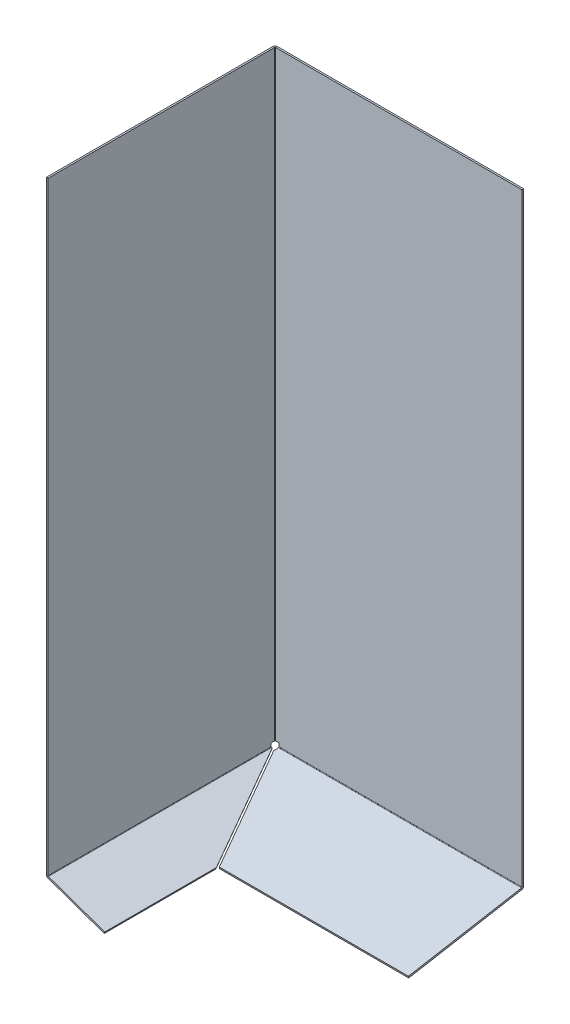
ISO-10303-21;
HEADER;
FILE_DESCRIPTION(('STEP AP214'),'2;1');
FILE_NAME('part.step','',(''),(''),'','','');
FILE_SCHEMA(('AUTOMOTIVE_DESIGN { 1 0 10303 214 1 1 1 1 }'));
ENDSEC;
DATA;
#1=APPLICATION_CONTEXT('core data for automotive mechanical design processes');
#2=APPLICATION_PROTOCOL_DEFINITION('international standard','automotive_design',2000,#1);
#3=PRODUCT_CONTEXT('',#1,'mechanical');
#4=PRODUCT('Part','Part','',(#3));
#5=PRODUCT_RELATED_PRODUCT_CATEGORY('part','',(#4));
#6=PRODUCT_DEFINITION_FORMATION('','',#4);
#7=PRODUCT_DEFINITION_CONTEXT('part definition',#1,'design');
#8=PRODUCT_DEFINITION('design','',#6,#7);
#9=PRODUCT_DEFINITION_SHAPE('','',#8);
#10=(LENGTH_UNIT() NAMED_UNIT(*) SI_UNIT(.MILLI.,.METRE.));
#11=(NAMED_UNIT(*) PLANE_ANGLE_UNIT() SI_UNIT($,.RADIAN.));
#12=(NAMED_UNIT(*) SI_UNIT($,.STERADIAN.) SOLID_ANGLE_UNIT());
#13=UNCERTAINTY_MEASURE_WITH_UNIT(LENGTH_MEASURE(1.E-05),#10,'distance_accuracy_value','');
#14=(GEOMETRIC_REPRESENTATION_CONTEXT(3) GLOBAL_UNCERTAINTY_ASSIGNED_CONTEXT((#13)) GLOBAL_UNIT_ASSIGNED_CONTEXT((#10,
#11,#12)) REPRESENTATION_CONTEXT('',''));
#15=CARTESIAN_POINT('',(0.,0.,0.));
#16=DIRECTION('',(0.,0.,1.));
#17=DIRECTION('',(1.,0.,0.));
#18=AXIS2_PLACEMENT_3D('',#15,#16,#17);
#19=CARTESIAN_POINT('',(0.,1100.,6.74999999999996));
#20=DIRECTION('',(0.,0.,1.));
#21=DIRECTION('',(0.,-1.,0.));
#22=AXIS2_PLACEMENT_3D('',#19,#20,#21);
#23=PLANE('',#22);
#24=DIRECTION('',(1.,0.,0.));
#25=VECTOR('',#24,1.);
#26=CARTESIAN_POINT('',(0.,35.9731028814059,6.74999999999996));
#27=LINE('',#26,#25);
#28=CARTESIAN_POINT('',(-3.,35.9731028814059,6.74999999999996));
#29=VERTEX_POINT('',#28);
#30=CARTESIAN_POINT('',(0.,35.9731028814059,6.74999999999996));
#31=VERTEX_POINT('',#30);
#32=EDGE_CURVE('E11',#29,#31,#27,.T.);
#33=ORIENTED_EDGE('',*,*,#32,.F.);
#34=DIRECTION('',(0.,1.,0.));
#35=VECTOR('',#34,1.);
#36=CARTESIAN_POINT('',(-3.,1100.,6.74999999999996));
#37=LINE('',#36,#35);
#38=CARTESIAN_POINT('',(-3.,42.0153961416918,6.74999999999996));
#39=VERTEX_POINT('',#38);
#40=EDGE_CURVE('E228',#39,#29,#37,.F.);
#41=ORIENTED_EDGE('',*,*,#40,.F.);
#42=DIRECTION('',(1.,0.,0.));
#43=VECTOR('',#42,1.);
#44=CARTESIAN_POINT('',(0.,42.0153961416918,6.74999999999996));
#45=LINE('',#44,#43);
#46=CARTESIAN_POINT('',(0.,42.0153961416918,6.74999999999996));
#47=VERTEX_POINT('',#46);
#48=EDGE_CURVE('E47',#39,#47,#45,.T.);
#49=ORIENTED_EDGE('',*,*,#48,.T.);
#50=DIRECTION('',(0.,-1.,0.));
#51=VECTOR('',#50,1.);
#52=CARTESIAN_POINT('',(0.,1100.,6.74999999999996));
#53=LINE('',#52,#51);
#54=EDGE_CURVE('E293',#47,#31,#53,.T.);
#55=ORIENTED_EDGE('',*,*,#54,.T.);
#56=EDGE_LOOP('',(#33,#41,#49,#55));
#57=FACE_BOUND('',#56,.T.);
#58=ADVANCED_FACE('F37',(#57),#23,.F.);
#59=CARTESIAN_POINT('',(0.,42.0153961416918,0.));
#60=DIRECTION('',(0.,1.,0.));
#61=DIRECTION('',(0.,0.,1.));
#62=AXIS2_PLACEMENT_3D('',#59,#60,#61);
#63=PLANE('',#62);
#64=ORIENTED_EDGE('',*,*,#48,.F.);
#65=DIRECTION('',(0.,0.,-1.));
#66=VECTOR('',#65,1.);
#67=CARTESIAN_POINT('',(-3.,42.0153961416918,0.));
#68=LINE('',#67,#66);
#69=CARTESIAN_POINT('',(-3.,42.0153961416918,1.));
#70=VERTEX_POINT('',#69);
#71=EDGE_CURVE('E220',#70,#39,#68,.F.);
#72=ORIENTED_EDGE('',*,*,#71,.F.);
#73=DIRECTION('',(1.,0.,0.));
#74=VECTOR('',#73,1.);
#75=CARTESIAN_POINT('',(0.,42.0153961416918,1.));
#76=LINE('',#75,#74);
#77=CARTESIAN_POINT('',(0.,42.0153961416918,1.));
#78=VERTEX_POINT('',#77);
#79=EDGE_CURVE('E287',#70,#78,#76,.T.);
#80=ORIENTED_EDGE('',*,*,#79,.T.);
#81=DIRECTION('',(0.,0.,1.));
#82=VECTOR('',#81,1.);
#83=CARTESIAN_POINT('',(0.,42.0153961416918,0.));
#84=LINE('',#83,#82);
#85=EDGE_CURVE('E305',#78,#47,#84,.T.);
#86=ORIENTED_EDGE('',*,*,#85,.T.);
#87=EDGE_LOOP('',(#64,#72,#80,#86));
#88=FACE_BOUND('',#87,.T.);
#89=ADVANCED_FACE('F312',(#88),#63,.F.);
#90=CARTESIAN_POINT('',(1.,42.0153961416918,1.));
#91=DIRECTION('',(0.,-1.,0.));
#92=DIRECTION('',(0.,0.,-1.));
#93=AXIS2_PLACEMENT_3D('',#90,#91,#92);
#94=PLANE('',#93);
#95=ORIENTED_EDGE('',*,*,#79,.F.);
#96=CARTESIAN_POINT('',(1.,42.0153961416918,1.));
#97=DIRECTION('',(0.,1.,0.));
#98=DIRECTION('',(0.,0.,1.));
#99=AXIS2_PLACEMENT_3D('',#96,#97,#98);
#100=CIRCLE('',#99,4.);
#101=CARTESIAN_POINT('',(1.,42.0153961416918,-3.));
#102=VERTEX_POINT('',#101);
#103=EDGE_CURVE('E205',#70,#102,#100,.F.);
#104=ORIENTED_EDGE('',*,*,#103,.T.);
#105=DIRECTION('',(0.,0.,1.));
#106=VECTOR('',#105,1.);
#107=CARTESIAN_POINT('',(1.,42.0153961416918,0.));
#108=LINE('',#107,#106);
#109=CARTESIAN_POINT('',(1.,42.0153961416918,0.));
#110=VERTEX_POINT('',#109);
#111=EDGE_CURVE('E284',#102,#110,#108,.T.);
#112=ORIENTED_EDGE('',*,*,#111,.T.);
#113=CARTESIAN_POINT('',(1.,42.0153961416918,1.));
#114=DIRECTION('',(0.,1.,0.));
#115=DIRECTION('',(0.,0.,1.));
#116=AXIS2_PLACEMENT_3D('',#113,#114,#115);
#117=CIRCLE('',#116,1.);
#118=EDGE_CURVE('E349',#78,#110,#117,.F.);
#119=ORIENTED_EDGE('',*,*,#118,.F.);
#120=EDGE_LOOP('',(#95,#104,#112,#119));
#121=FACE_BOUND('',#120,.T.);
#122=ADVANCED_FACE('F511',(#121),#94,.T.);
#123=CARTESIAN_POINT('',(0.,42.0153961416918,0.));
#124=DIRECTION('',(0.,1.,0.));
#125=DIRECTION('',(-1.,0.,0.));
#126=AXIS2_PLACEMENT_3D('',#123,#124,#125);
#127=PLANE('',#126);
#128=ORIENTED_EDGE('',*,*,#111,.F.);
#129=DIRECTION('',(1.,0.,0.));
#130=VECTOR('',#129,1.);
#131=CARTESIAN_POINT('',(0.,42.0153961416918,-3.));
#132=LINE('',#131,#130);
#133=CARTESIAN_POINT('',(6.74999999999996,42.0153961416918,-3.));
#134=VERTEX_POINT('',#133);
#135=EDGE_CURVE('E225',#134,#102,#132,.F.);
#136=ORIENTED_EDGE('',*,*,#135,.F.);
#137=DIRECTION('',(0.,0.,1.));
#138=VECTOR('',#137,1.);
#139=CARTESIAN_POINT('',(6.74999999999996,42.0153961416918,0.));
#140=LINE('',#139,#138);
#141=CARTESIAN_POINT('',(6.74999999999996,42.0153961416918,0.));
#142=VERTEX_POINT('',#141);
#143=EDGE_CURVE('E281',#134,#142,#140,.T.);
#144=ORIENTED_EDGE('',*,*,#143,.T.);
#145=DIRECTION('',(-1.,0.,0.));
#146=VECTOR('',#145,1.);
#147=CARTESIAN_POINT('',(0.,42.0153961416918,0.));
#148=LINE('',#147,#146);
#149=EDGE_CURVE('E310',#142,#110,#148,.T.);
#150=ORIENTED_EDGE('',*,*,#149,.T.);
#151=EDGE_LOOP('',(#128,#136,#144,#150));
#152=FACE_BOUND('',#151,.T.);
#153=ADVANCED_FACE('F431',(#152),#127,.F.);
#154=CARTESIAN_POINT('',(6.74999999999996,1100.,0.));
#155=DIRECTION('',(1.,0.,0.));
#156=DIRECTION('',(0.,1.,0.));
#157=AXIS2_PLACEMENT_3D('',#154,#155,#156);
#158=PLANE('',#157);
#159=ORIENTED_EDGE('',*,*,#143,.F.);
#160=DIRECTION('',(0.,1.,0.));
#161=VECTOR('',#160,1.);
#162=CARTESIAN_POINT('',(6.74999999999996,1100.,-3.));
#163=LINE('',#162,#161);
#164=CARTESIAN_POINT('',(6.74999999999996,36.1044957728691,-3.));
#165=VERTEX_POINT('',#164);
#166=EDGE_CURVE('E185',#165,#134,#163,.T.);
#167=ORIENTED_EDGE('',*,*,#166,.F.);
#168=DIRECTION('',(0.,0.,1.));
#169=VECTOR('',#168,1.);
#170=CARTESIAN_POINT('',(6.74999999999996,36.1044957728691,0.));
#171=LINE('',#170,#169);
#172=CARTESIAN_POINT('',(6.74999999999996,36.1044957728691,0.));
#173=VERTEX_POINT('',#172);
#174=EDGE_CURVE('E278',#165,#173,#171,.T.);
#175=ORIENTED_EDGE('',*,*,#174,.T.);
#176=DIRECTION('',(0.,1.,0.));
#177=VECTOR('',#176,1.);
#178=CARTESIAN_POINT('',(6.74999999999996,1100.,0.));
#179=LINE('',#178,#177);
#180=EDGE_CURVE('E426',#173,#142,#179,.T.);
#181=ORIENTED_EDGE('',*,*,#180,.T.);
#182=EDGE_LOOP('',(#159,#167,#175,#181));
#183=FACE_BOUND('',#182,.T.);
#184=ADVANCED_FACE('F519',(#183),#158,.F.);
#185=CARTESIAN_POINT('',(6.74999999999996,36.1044957728691,1.));
#186=DIRECTION('',(-1.,0.,0.));
#187=DIRECTION('',(0.,0.,1.));
#188=AXIS2_PLACEMENT_3D('',#185,#186,#187);
#189=PLANE('',#188);
#190=ORIENTED_EDGE('',*,*,#174,.F.);
#191=CARTESIAN_POINT('',(6.74999999999996,36.1044957728691,1.));
#192=DIRECTION('',(-1.,0.,0.));
#193=DIRECTION('',(0.,-1.,0.));
#194=AXIS2_PLACEMENT_3D('',#191,#192,#193);
#195=CIRCLE('',#194,4.);
#196=CARTESIAN_POINT('',(6.74999999999996,32.1652647608203,0.305407289332188));
#197=VERTEX_POINT('',#196);
#198=EDGE_CURVE('E168',#165,#197,#195,.T.);
#199=ORIENTED_EDGE('',*,*,#198,.T.);
#200=DIRECTION('',(0.,0.984807753012209,0.173648177666925));
#201=VECTOR('',#200,1.);
#202=CARTESIAN_POINT('',(6.74999999999996,35.1196880198569,0.826351822333038));
#203=LINE('',#202,#201);
#204=CARTESIAN_POINT('',(6.74999999999996,35.1196880198569,0.826351822333038));
#205=VERTEX_POINT('',#204);
#206=EDGE_CURVE('E275',#197,#205,#203,.T.);
#207=ORIENTED_EDGE('',*,*,#206,.T.);
#208=CARTESIAN_POINT('',(6.74999999999996,36.1044957728691,1.));
#209=DIRECTION('',(1.,0.,0.));
#210=DIRECTION('',(0.,0.,-1.));
#211=AXIS2_PLACEMENT_3D('',#208,#209,#210);
#212=CIRCLE('',#211,1.);
#213=EDGE_CURVE('E330',#173,#205,#212,.F.);
#214=ORIENTED_EDGE('',*,*,#213,.F.);
#215=EDGE_LOOP('',(#190,#199,#207,#214));
#216=FACE_BOUND('',#215,.T.);
#217=ADVANCED_FACE('F375',(#216),#189,.T.);
#218=CARTESIAN_POINT('',(6.74999999999998,0.,200.));
#219=DIRECTION('',(1.,0.,0.));
#220=DIRECTION('',(0.,0.173648177666925,-0.984807753012209));
#221=AXIS2_PLACEMENT_3D('',#218,#219,#220);
#222=PLANE('',#221);
#223=ORIENTED_EDGE('',*,*,#206,.F.);
#224=DIRECTION('',(0.,-0.173648177666925,0.984807753012209));
#225=VECTOR('',#224,1.);
#226=CARTESIAN_POINT('',(6.74999999999996,-2.95442325903665,199.479055466999));
#227=LINE('',#226,#225);
#228=CARTESIAN_POINT('',(6.74999999999996,31.1207657628731,6.2290554669992));
#229=VERTEX_POINT('',#228);
#230=EDGE_CURVE('E177',#229,#197,#227,.F.);
#231=ORIENTED_EDGE('',*,*,#230,.F.);
#232=DIRECTION('',(0.,0.984807753012209,0.173648177666925));
#233=VECTOR('',#232,1.);
#234=CARTESIAN_POINT('',(6.74999999999996,34.0751890219097,6.74999999999998));
#235=LINE('',#234,#233);
#236=CARTESIAN_POINT('',(6.74999999999996,34.0751890219097,6.74999999999998));
#237=VERTEX_POINT('',#236);
#238=EDGE_CURVE('E272',#229,#237,#235,.T.);
#239=ORIENTED_EDGE('',*,*,#238,.T.);
#240=DIRECTION('',(0.,0.173648177666925,-0.984807753012209));
#241=VECTOR('',#240,1.);
#242=CARTESIAN_POINT('',(6.74999999999998,0.,200.));
#243=LINE('',#242,#241);
#244=EDGE_CURVE('E313',#237,#205,#243,.T.);
#245=ORIENTED_EDGE('',*,*,#244,.T.);
#246=EDGE_LOOP('',(#223,#231,#239,#245));
#247=FACE_BOUND('',#246,.T.);
#248=ADVANCED_FACE('F524',(#247),#222,.F.);
#249=CARTESIAN_POINT('',(-0.000999999999998438,34.0751890219097,6.74999999999995));
#250=DIRECTION('',(0.,-0.173648177666925,0.984807753012209));
#251=DIRECTION('',(1.,0.,0.));
#252=AXIS2_PLACEMENT_3D('',#249,#250,#251);
#253=PLANE('',#252);
#254=ORIENTED_EDGE('',*,*,#238,.F.);
#255=DIRECTION('',(1.,0.,0.));
#256=VECTOR('',#255,1.);
#257=CARTESIAN_POINT('',(-0.000999999999973317,31.1207657628731,6.22905546699914));
#258=LINE('',#257,#256);
#259=CARTESIAN_POINT('',(5.15278291241441,31.1207657628731,6.22905546699914));
#260=VERTEX_POINT('',#259);
#261=EDGE_CURVE('E173',#260,#229,#258,.T.);
#262=ORIENTED_EDGE('',*,*,#261,.F.);
#263=DIRECTION('',(0.,0.984807753012209,0.173648177666925));
#264=VECTOR('',#263,1.);
#265=CARTESIAN_POINT('',(5.15278291241442,34.0751890219097,6.74999999999994));
#266=LINE('',#265,#264);
#267=CARTESIAN_POINT('',(5.15278291241442,34.0751890219097,6.74999999999994));
#268=VERTEX_POINT('',#267);
#269=EDGE_CURVE('E269',#260,#268,#266,.T.);
#270=ORIENTED_EDGE('',*,*,#269,.T.);
#271=DIRECTION('',(1.,0.,0.));
#272=VECTOR('',#271,1.);
#273=CARTESIAN_POINT('',(-0.000999999999998438,34.0751890219097,6.74999999999995));
#274=LINE('',#273,#272);
#275=EDGE_CURVE('E316',#268,#237,#274,.T.);
#276=ORIENTED_EDGE('',*,*,#275,.T.);
#277=EDGE_LOOP('',(#254,#262,#270,#276));
#278=FACE_BOUND('',#277,.T.);
#279=ADVANCED_FACE('F527',(#278),#253,.F.);
#280=CARTESIAN_POINT('',(101.430855444118,0.122345346018898,199.306145063408));
#281=DIRECTION('',(-0.897136479422749,-0.0767096868187111,0.43504225224354));
#282=DIRECTION('',(0.441753480222801,-0.155786114770281,0.883506960445601));
#283=AXIS2_PLACEMENT_3D('',#280,#281,#282);
#284=PLANE('',#283);
#285=ORIENTED_EDGE('',*,*,#269,.F.);
#286=DIRECTION('',(0.441753480222801,-0.155786114770281,0.883506960445601));
#287=VECTOR('',#286,1.);
#288=CARTESIAN_POINT('',(101.430855444118,-2.83207791301773,198.785200530407));
#289=LINE('',#288,#287);
#290=CARTESIAN_POINT('',(101.777782912414,-2.95442325903665,199.479055466999));
#291=VERTEX_POINT('',#290);
#292=EDGE_CURVE('E186',#260,#291,#289,.T.);
#293=ORIENTED_EDGE('',*,*,#292,.T.);
#294=DIRECTION('',(0.,0.984807753012209,0.173648177666925));
#295=VECTOR('',#294,1.);
#296=CARTESIAN_POINT('',(101.777782912414,0.,200.));
#297=LINE('',#296,#295);
#298=CARTESIAN_POINT('',(101.777782912414,0.,200.));
#299=VERTEX_POINT('',#298);
#300=EDGE_CURVE('E266',#291,#299,#297,.T.);
#301=ORIENTED_EDGE('',*,*,#300,.T.);
#302=DIRECTION('',(0.441753480222801,-0.155786114770281,0.883506960445601));
#303=VECTOR('',#302,1.);
#304=CARTESIAN_POINT('',(101.430855444118,0.122345346018898,199.306145063408));
#305=LINE('',#304,#303);
#306=EDGE_CURVE('E421',#268,#299,#305,.T.);
#307=ORIENTED_EDGE('',*,*,#306,.F.);
#308=EDGE_LOOP('',(#285,#293,#301,#307));
#309=FACE_BOUND('',#308,.T.);
#310=ADVANCED_FACE('F530',(#309),#284,.T.);
#311=CARTESIAN_POINT('',(-0.000999999999973245,0.,200.));
#312=DIRECTION('',(0.,-0.173648177666925,0.984807753012209));
#313=DIRECTION('',(1.,0.,0.));
#314=AXIS2_PLACEMENT_3D('',#311,#312,#313);
#315=PLANE('',#314);
#316=ORIENTED_EDGE('',*,*,#300,.F.);
#317=DIRECTION('',(1.,0.,0.));
#318=VECTOR('',#317,1.);
#319=CARTESIAN_POINT('',(-0.000999999999973317,-2.95442325903665,199.479055466999));
#320=LINE('',#319,#318);
#321=CARTESIAN_POINT('',(435.,-2.95442325903665,199.479055466999));
#322=VERTEX_POINT('',#321);
#323=EDGE_CURVE('E197',#291,#322,#320,.T.);
#324=ORIENTED_EDGE('',*,*,#323,.T.);
#325=DIRECTION('',(0.,0.984807753012209,0.173648177666925));
#326=VECTOR('',#325,1.);
#327=CARTESIAN_POINT('',(435.,0.,200.));
#328=LINE('',#327,#326);
#329=CARTESIAN_POINT('',(435.,0.,200.));
#330=VERTEX_POINT('',#329);
#331=EDGE_CURVE('E263',#322,#330,#328,.T.);
#332=ORIENTED_EDGE('',*,*,#331,.T.);
#333=DIRECTION('',(1.,0.,0.));
#334=VECTOR('',#333,1.);
#335=CARTESIAN_POINT('',(-0.000999999999973245,0.,200.));
#336=LINE('',#335,#334);
#337=EDGE_CURVE('E409',#299,#330,#336,.T.);
#338=ORIENTED_EDGE('',*,*,#337,.F.);
#339=EDGE_LOOP('',(#316,#324,#332,#338));
#340=FACE_BOUND('',#339,.T.);
#341=ADVANCED_FACE('F534',(#340),#315,.T.);
#342=CARTESIAN_POINT('',(435.,0.,200.));
#343=DIRECTION('',(-1.,0.,0.));
#344=DIRECTION('',(0.,-0.173648177666925,0.984807753012209));
#345=AXIS2_PLACEMENT_3D('',#342,#343,#344);
#346=PLANE('',#345);
#347=ORIENTED_EDGE('',*,*,#331,.F.);
#348=DIRECTION('',(0.,-0.173648177666925,0.984807753012209));
#349=VECTOR('',#348,1.);
#350=CARTESIAN_POINT('',(435.,-2.95442325903666,199.479055466999));
#351=LINE('',#350,#349);
#352=CARTESIAN_POINT('',(435.,32.1652647608202,0.305407289332231));
#353=VERTEX_POINT('',#352);
#354=EDGE_CURVE('E191',#353,#322,#351,.T.);
#355=ORIENTED_EDGE('',*,*,#354,.F.);
#356=DIRECTION('',(-1.1102230246251E-13,0.984807753012204,0.173648177666954));
#357=VECTOR('',#356,1.);
#358=CARTESIAN_POINT('',(435.,35.1196880198569,0.826351822333038));
#359=LINE('',#358,#357);
#360=CARTESIAN_POINT('',(435.,35.1196880198569,0.826351822333038));
#361=VERTEX_POINT('',#360);
#362=EDGE_CURVE('E260',#353,#361,#359,.T.);
#363=ORIENTED_EDGE('',*,*,#362,.T.);
#364=DIRECTION('',(0.,-0.173648177666925,0.984807753012209));
#365=VECTOR('',#364,1.);
#366=CARTESIAN_POINT('',(435.,0.,200.));
#367=LINE('',#366,#365);
#368=EDGE_CURVE('E401',#361,#330,#367,.T.);
#369=ORIENTED_EDGE('',*,*,#368,.T.);
#370=EDGE_LOOP('',(#347,#355,#363,#369));
#371=FACE_BOUND('',#370,.T.);
#372=ADVANCED_FACE('F399',(#371),#346,.F.);
#373=CARTESIAN_POINT('',(435.,36.1044957728691,1.));
#374=DIRECTION('',(1.,0.,0.));
#375=DIRECTION('',(0.,0.,-1.));
#376=AXIS2_PLACEMENT_3D('',#373,#374,#375);
#377=PLANE('',#376);
#378=ORIENTED_EDGE('',*,*,#362,.F.);
#379=CARTESIAN_POINT('',(435.,36.1044957728691,1.));
#380=DIRECTION('',(-1.,0.,0.));
#381=DIRECTION('',(0.,-1.,0.));
#382=AXIS2_PLACEMENT_3D('',#379,#380,#381);
#383=CIRCLE('',#382,4.);
#384=CARTESIAN_POINT('',(435.,36.1044957728691,-3.));
#385=VERTEX_POINT('',#384);
#386=EDGE_CURVE('E204',#353,#385,#383,.F.);
#387=ORIENTED_EDGE('',*,*,#386,.T.);
#388=DIRECTION('',(0.,0.,1.));
#389=VECTOR('',#388,1.);
#390=CARTESIAN_POINT('',(435.,36.1044957728691,0.));
#391=LINE('',#390,#389);
#392=CARTESIAN_POINT('',(435.,36.1044957728691,0.));
#393=VERTEX_POINT('',#392);
#394=EDGE_CURVE('E257',#385,#393,#391,.T.);
#395=ORIENTED_EDGE('',*,*,#394,.T.);
#396=CARTESIAN_POINT('',(435.,36.1044957728691,1.));
#397=DIRECTION('',(-1.,0.,0.));
#398=DIRECTION('',(0.,0.,1.));
#399=AXIS2_PLACEMENT_3D('',#396,#397,#398);
#400=CIRCLE('',#399,1.);
#401=EDGE_CURVE('E340',#361,#393,#400,.F.);
#402=ORIENTED_EDGE('',*,*,#401,.F.);
#403=EDGE_LOOP('',(#378,#387,#395,#402));
#404=FACE_BOUND('',#403,.T.);
#405=ADVANCED_FACE('F391',(#404),#377,.T.);
#406=CARTESIAN_POINT('',(435.,1100.,0.));
#407=DIRECTION('',(-1.,0.,0.));
#408=DIRECTION('',(0.,-1.,0.));
#409=AXIS2_PLACEMENT_3D('',#406,#407,#408);
#410=PLANE('',#409);
#411=ORIENTED_EDGE('',*,*,#394,.F.);
#412=DIRECTION('',(0.,1.,0.));
#413=VECTOR('',#412,1.);
#414=CARTESIAN_POINT('',(435.,1100.,-3.));
#415=LINE('',#414,#413);
#416=CARTESIAN_POINT('',(435.,1100.,-3.));
#417=VERTEX_POINT('',#416);
#418=EDGE_CURVE('E193',#417,#385,#415,.F.);
#419=ORIENTED_EDGE('',*,*,#418,.F.);
#420=DIRECTION('',(0.,0.,1.));
#421=VECTOR('',#420,1.);
#422=CARTESIAN_POINT('',(435.,1100.,0.));
#423=LINE('',#422,#421);
#424=CARTESIAN_POINT('',(435.,1100.,0.));
#425=VERTEX_POINT('',#424);
#426=EDGE_CURVE('E254',#417,#425,#423,.T.);
#427=ORIENTED_EDGE('',*,*,#426,.T.);
#428=DIRECTION('',(0.,-1.,0.));
#429=VECTOR('',#428,1.);
#430=CARTESIAN_POINT('',(435.,1100.,0.));
#431=LINE('',#430,#429);
#432=EDGE_CURVE('E333',#425,#393,#431,.T.);
#433=ORIENTED_EDGE('',*,*,#432,.T.);
#434=EDGE_LOOP('',(#411,#419,#427,#433));
#435=FACE_BOUND('',#434,.T.);
#436=ADVANCED_FACE('F472',(#435),#410,.F.);
#437=CARTESIAN_POINT('',(0.,1100.,0.));
#438=DIRECTION('',(0.,1.,0.));
#439=DIRECTION('',(-1.,0.,0.));
#440=AXIS2_PLACEMENT_3D('',#437,#438,#439);
#441=PLANE('',#440);
#442=ORIENTED_EDGE('',*,*,#426,.F.);
#443=DIRECTION('',(1.,0.,0.));
#444=VECTOR('',#443,1.);
#445=CARTESIAN_POINT('',(0.,1100.,-3.));
#446=LINE('',#445,#444);
#447=CARTESIAN_POINT('',(1.,1100.,-3.));
#448=VERTEX_POINT('',#447);
#449=EDGE_CURVE('E201',#417,#448,#446,.F.);
#450=ORIENTED_EDGE('',*,*,#449,.T.);
#451=DIRECTION('',(0.,0.,1.));
#452=VECTOR('',#451,1.);
#453=CARTESIAN_POINT('',(1.,1100.,0.));
#454=LINE('',#453,#452);
#455=CARTESIAN_POINT('',(1.,1100.,0.));
#456=VERTEX_POINT('',#455);
#457=EDGE_CURVE('E251',#448,#456,#454,.T.);
#458=ORIENTED_EDGE('',*,*,#457,.T.);
#459=DIRECTION('',(-1.,0.,0.));
#460=VECTOR('',#459,1.);
#461=CARTESIAN_POINT('',(0.,1100.,0.));
#462=LINE('',#461,#460);
#463=EDGE_CURVE('E439',#425,#456,#462,.T.);
#464=ORIENTED_EDGE('',*,*,#463,.F.);
#465=EDGE_LOOP('',(#442,#450,#458,#464));
#466=FACE_BOUND('',#465,.T.);
#467=ADVANCED_FACE('F474',(#466),#441,.T.);
#468=CARTESIAN_POINT('',(1.,1100.,1.));
#469=DIRECTION('',(0.,1.,0.));
#470=DIRECTION('',(0.,0.,1.));
#471=AXIS2_PLACEMENT_3D('',#468,#469,#470);
#472=PLANE('',#471);
#473=ORIENTED_EDGE('',*,*,#457,.F.);
#474=CARTESIAN_POINT('',(1.,1100.,1.));
#475=DIRECTION('',(0.,1.,0.));
#476=DIRECTION('',(0.,0.,1.));
#477=AXIS2_PLACEMENT_3D('',#474,#475,#476);
#478=CIRCLE('',#477,4.);
#479=CARTESIAN_POINT('',(-3.,1100.,0.999999999999999));
#480=VERTEX_POINT('',#479);
#481=EDGE_CURVE('E202',#448,#480,#478,.T.);
#482=ORIENTED_EDGE('',*,*,#481,.T.);
#483=DIRECTION('',(1.,0.,0.));
#484=VECTOR('',#483,1.);
#485=CARTESIAN_POINT('',(0.,1100.,1.));
#486=LINE('',#485,#484);
#487=CARTESIAN_POINT('',(0.,1100.,1.));
#488=VERTEX_POINT('',#487);
#489=EDGE_CURVE('E55',#480,#488,#486,.T.);
#490=ORIENTED_EDGE('',*,*,#489,.T.);
#491=CARTESIAN_POINT('',(1.,1100.,1.));
#492=DIRECTION('',(0.,-1.,0.));
#493=DIRECTION('',(0.,0.,-1.));
#494=AXIS2_PLACEMENT_3D('',#491,#492,#493);
#495=CIRCLE('',#494,1.);
#496=EDGE_CURVE('E343',#456,#488,#495,.F.);
#497=ORIENTED_EDGE('',*,*,#496,.F.);
#498=EDGE_LOOP('',(#473,#482,#490,#497));
#499=FACE_BOUND('',#498,.T.);
#500=ADVANCED_FACE('F547',(#499),#472,.T.);
#501=CARTESIAN_POINT('',(0.,1100.,0.));
#502=DIRECTION('',(0.,1.,0.));
#503=DIRECTION('',(0.,0.,1.));
#504=AXIS2_PLACEMENT_3D('',#501,#502,#503);
#505=PLANE('',#504);
#506=ORIENTED_EDGE('',*,*,#489,.F.);
#507=DIRECTION('',(0.,0.,-1.));
#508=VECTOR('',#507,1.);
#509=CARTESIAN_POINT('',(-3.,1100.,0.));
#510=LINE('',#509,#508);
#511=CARTESIAN_POINT('',(-2.99999999999995,1100.,400.));
#512=VERTEX_POINT('',#511);
#513=EDGE_CURVE('E198',#480,#512,#510,.F.);
#514=ORIENTED_EDGE('',*,*,#513,.T.);
#515=DIRECTION('',(1.,0.,0.));
#516=VECTOR('',#515,1.);
#517=CARTESIAN_POINT('',(0.,1100.,400.));
#518=LINE('',#517,#516);
#519=CARTESIAN_POINT('',(0.,1100.,400.));
#520=VERTEX_POINT('',#519);
#521=EDGE_CURVE('E247',#512,#520,#518,.T.);
#522=ORIENTED_EDGE('',*,*,#521,.T.);
#523=DIRECTION('',(0.,0.,1.));
#524=VECTOR('',#523,1.);
#525=CARTESIAN_POINT('',(0.,1100.,0.));
#526=LINE('',#525,#524);
#527=EDGE_CURVE('E475',#488,#520,#526,.T.);
#528=ORIENTED_EDGE('',*,*,#527,.F.);
#529=EDGE_LOOP('',(#506,#514,#522,#528));
#530=FACE_BOUND('',#529,.T.);
#531=ADVANCED_FACE('F550',(#530),#505,.T.);
#532=CARTESIAN_POINT('',(0.,1100.,400.));
#533=DIRECTION('',(0.,0.,1.));
#534=DIRECTION('',(0.,-1.,0.));
#535=AXIS2_PLACEMENT_3D('',#532,#533,#534);
#536=PLANE('',#535);
#537=ORIENTED_EDGE('',*,*,#521,.F.);
#538=DIRECTION('',(0.,1.,0.));
#539=VECTOR('',#538,1.);
#540=CARTESIAN_POINT('',(-2.99999999999995,1100.,400.));
#541=LINE('',#540,#539);
#542=CARTESIAN_POINT('',(-2.99999999999995,35.9731028814059,400.));
#543=VERTEX_POINT('',#542);
#544=EDGE_CURVE('E194',#512,#543,#541,.F.);
#545=ORIENTED_EDGE('',*,*,#544,.T.);
#546=DIRECTION('',(1.,0.,-1.11022302462516E-13));
#547=VECTOR('',#546,1.);
#548=CARTESIAN_POINT('',(0.,35.9731028814059,400.));
#549=LINE('',#548,#547);
#550=CARTESIAN_POINT('',(0.,35.9731028814059,400.));
#551=VERTEX_POINT('',#550);
#552=EDGE_CURVE('E244',#543,#551,#549,.T.);
#553=ORIENTED_EDGE('',*,*,#552,.T.);
#554=DIRECTION('',(0.,-1.,0.));
#555=VECTOR('',#554,1.);
#556=CARTESIAN_POINT('',(0.,1100.,400.));
#557=LINE('',#556,#555);
#558=EDGE_CURVE('E415',#520,#551,#557,.T.);
#559=ORIENTED_EDGE('',*,*,#558,.F.);
#560=EDGE_LOOP('',(#537,#545,#553,#559));
#561=FACE_BOUND('',#560,.T.);
#562=ADVANCED_FACE('F505',(#561),#536,.T.);
#563=CARTESIAN_POINT('',(1.00000000000005,35.9731028814059,400.));
#564=DIRECTION('',(0.,0.,-1.));
#565=DIRECTION('',(-1.,0.,0.));
#566=AXIS2_PLACEMENT_3D('',#563,#564,#565);
#567=PLANE('',#566);
#568=ORIENTED_EDGE('',*,*,#552,.F.);
#569=CARTESIAN_POINT('',(1.00000000000005,35.9731028814059,400.));
#570=DIRECTION('',(0.,0.,1.));
#571=DIRECTION('',(1.,0.,0.));
#572=AXIS2_PLACEMENT_3D('',#569,#570,#571);
#573=CIRCLE('',#572,4.);
#574=CARTESIAN_POINT('',(-0.33031698002675,32.2008016298285,400.));
#575=VERTEX_POINT('',#574);
#576=EDGE_CURVE('E167',#543,#575,#573,.T.);
#577=ORIENTED_EDGE('',*,*,#576,.T.);
#578=DIRECTION('',(0.332579245006692,0.943075312894351,0.));
#579=VECTOR('',#578,1.);
#580=CARTESIAN_POINT('',(0.667420754993348,35.0300275685115,400.));
#581=LINE('',#580,#579);
#582=CARTESIAN_POINT('',(0.667420754993348,35.0300275685115,400.));
#583=VERTEX_POINT('',#582);
#584=EDGE_CURVE('E241',#575,#583,#581,.T.);
#585=ORIENTED_EDGE('',*,*,#584,.T.);
#586=CARTESIAN_POINT('',(1.00000000000005,35.9731028814059,400.));
#587=DIRECTION('',(0.,0.,1.));
#588=DIRECTION('',(1.,0.,0.));
#589=AXIS2_PLACEMENT_3D('',#586,#587,#588);
#590=CIRCLE('',#589,1.);
#591=EDGE_CURVE('E329',#551,#583,#590,.T.);
#592=ORIENTED_EDGE('',*,*,#591,.F.);
#593=EDGE_LOOP('',(#568,#577,#585,#592));
#594=FACE_BOUND('',#593,.T.);
#595=ADVANCED_FACE('F483',(#594),#567,.F.);
#596=CARTESIAN_POINT('',(100.,0.,400.));
#597=DIRECTION('',(0.,0.,-1.));
#598=DIRECTION('',(-0.943075312894351,0.332579245006692,0.));
#599=AXIS2_PLACEMENT_3D('',#596,#597,#598);
#600=PLANE('',#599);
#601=ORIENTED_EDGE('',*,*,#584,.F.);
#602=DIRECTION('',(-0.943075312894351,0.332579245006692,0.));
#603=VECTOR('',#602,1.);
#604=CARTESIAN_POINT('',(99.0022622649799,-2.82922593868308,400.));
#605=LINE('',#604,#603);
#606=CARTESIAN_POINT('',(99.0022622649799,-2.82922593868308,400.));
#607=VERTEX_POINT('',#606);
#608=EDGE_CURVE('E157',#607,#575,#605,.T.);
#609=ORIENTED_EDGE('',*,*,#608,.F.);
#610=DIRECTION('',(0.332579245006692,0.943075312894351,0.));
#611=VECTOR('',#610,1.);
#612=CARTESIAN_POINT('',(100.,0.,400.));
#613=LINE('',#612,#611);
#614=CARTESIAN_POINT('',(100.,0.,400.));
#615=VERTEX_POINT('',#614);
#616=EDGE_CURVE('E238',#607,#615,#613,.T.);
#617=ORIENTED_EDGE('',*,*,#616,.T.);
#618=DIRECTION('',(-0.943075312894351,0.332579245006692,0.));
#619=VECTOR('',#618,1.);
#620=CARTESIAN_POINT('',(100.,0.,400.));
#621=LINE('',#620,#619);
#622=EDGE_CURVE('E410',#615,#583,#621,.T.);
#623=ORIENTED_EDGE('',*,*,#622,.T.);
#624=EDGE_LOOP('',(#601,#609,#617,#623));
#625=FACE_BOUND('',#624,.T.);
#626=ADVANCED_FACE('F497',(#625),#600,.F.);
#627=CARTESIAN_POINT('',(100.,0.,400.001));
#628=DIRECTION('',(0.943075312894351,-0.332579245006692,0.));
#629=DIRECTION('',(0.,0.,-1.));
#630=AXIS2_PLACEMENT_3D('',#627,#628,#629);
#631=PLANE('',#630);
#632=ORIENTED_EDGE('',*,*,#616,.F.);
#633=DIRECTION('',(0.,0.,1.));
#634=VECTOR('',#633,1.);
#635=CARTESIAN_POINT('',(99.0022622649799,-2.82922593868308,400.001));
#636=LINE('',#635,#634);
#637=CARTESIAN_POINT('',(99.0022622649799,-2.82922593868308,203.40489434868));
#638=VERTEX_POINT('',#637);
#639=EDGE_CURVE('E187',#607,#638,#636,.F.);
#640=ORIENTED_EDGE('',*,*,#639,.T.);
#641=DIRECTION('',(0.332579245006692,0.943075312894351,0.));
#642=VECTOR('',#641,1.);
#643=CARTESIAN_POINT('',(100.,0.,203.40489434868));
#644=LINE('',#643,#642);
#645=CARTESIAN_POINT('',(100.,0.,203.40489434868));
#646=VERTEX_POINT('',#645);
#647=EDGE_CURVE('E235',#638,#646,#644,.T.);
#648=ORIENTED_EDGE('',*,*,#647,.T.);
#649=DIRECTION('',(0.,0.,-1.));
#650=VECTOR('',#649,1.);
#651=CARTESIAN_POINT('',(100.,0.,400.001));
#652=LINE('',#651,#650);
#653=EDGE_CURVE('E413',#615,#646,#652,.T.);
#654=ORIENTED_EDGE('',*,*,#653,.F.);
#655=EDGE_LOOP('',(#632,#640,#648,#654));
#656=FACE_BOUND('',#655,.T.);
#657=ADVANCED_FACE('F495',(#656),#631,.T.);
#658=CARTESIAN_POINT('',(-1.32890396004392,35.7340393875439,0.747086428592474));
#659=DIRECTION('',(0.833213603166572,-0.293836077863156,-0.468418030016112));
#660=DIRECTION('',(-0.441753480222801,0.155786114770281,-0.883506960445601));
#661=AXIS2_PLACEMENT_3D('',#658,#659,#660);
#662=PLANE('',#661);
#663=ORIENTED_EDGE('',*,*,#647,.F.);
#664=DIRECTION('',(-0.441753480222801,0.155786114770281,-0.883506960445601));
#665=VECTOR('',#664,1.);
#666=CARTESIAN_POINT('',(-2.32664169506399,32.9048134488608,0.747086428592474));
#667=LINE('',#666,#665);
#668=CARTESIAN_POINT('',(0.674815090639796,31.8463378233607,6.74999999999998));
#669=VERTEX_POINT('',#668);
#670=EDGE_CURVE('E183',#638,#669,#667,.T.);
#671=ORIENTED_EDGE('',*,*,#670,.T.);
#672=DIRECTION('',(0.332579245006692,0.943075312894351,0.));
#673=VECTOR('',#672,1.);
#674=CARTESIAN_POINT('',(1.67255282565985,34.6755637620438,6.75));
#675=LINE('',#674,#673);
#676=CARTESIAN_POINT('',(1.67255282565985,34.6755637620438,6.75));
#677=VERTEX_POINT('',#676);
#678=EDGE_CURVE('E145',#669,#677,#675,.T.);
#679=ORIENTED_EDGE('',*,*,#678,.T.);
#680=DIRECTION('',(-0.441753480222801,0.155786114770281,-0.883506960445601));
#681=VECTOR('',#680,1.);
#682=CARTESIAN_POINT('',(-1.32890396004392,35.7340393875439,0.747086428592474));
#683=LINE('',#682,#681);
#684=EDGE_CURVE('E423',#646,#677,#683,.T.);
#685=ORIENTED_EDGE('',*,*,#684,.F.);
#686=EDGE_LOOP('',(#663,#671,#679,#685));
#687=FACE_BOUND('',#686,.T.);
#688=ADVANCED_FACE('F493',(#687),#662,.T.);
#689=CARTESIAN_POINT('',(100.,0.,6.74999999999998));
#690=DIRECTION('',(0.,0.,1.));
#691=DIRECTION('',(0.943075312894351,-0.332579245006692,0.));
#692=AXIS2_PLACEMENT_3D('',#689,#690,#691);
#693=PLANE('',#692);
#694=ORIENTED_EDGE('',*,*,#678,.F.);
#695=DIRECTION('',(-0.943075312894351,0.332579245006692,0.));
#696=VECTOR('',#695,1.);
#697=CARTESIAN_POINT('',(99.0022622649799,-2.82922593868308,6.74999999999998));
#698=LINE('',#697,#696);
#699=CARTESIAN_POINT('',(-0.330316980026751,32.2008016298285,6.74999999999998));
#700=VERTEX_POINT('',#699);
#701=EDGE_CURVE('E154',#700,#669,#698,.F.);
#702=ORIENTED_EDGE('',*,*,#701,.F.);
#703=DIRECTION('',(0.33257924500668,0.943075312894355,0.));
#704=VECTOR('',#703,1.);
#705=CARTESIAN_POINT('',(0.66742075499332,35.0300275685115,6.74999999999999));
#706=LINE('',#705,#704);
#707=CARTESIAN_POINT('',(0.66742075499332,35.0300275685115,6.74999999999999));
#708=VERTEX_POINT('',#707);
#709=EDGE_CURVE('E41',#700,#708,#706,.T.);
#710=ORIENTED_EDGE('',*,*,#709,.T.);
#711=DIRECTION('',(0.943075312894351,-0.332579245006692,0.));
#712=VECTOR('',#711,1.);
#713=CARTESIAN_POINT('',(100.,0.,6.74999999999998));
#714=LINE('',#713,#712);
#715=EDGE_CURVE('E319',#708,#677,#714,.T.);
#716=ORIENTED_EDGE('',*,*,#715,.T.);
#717=EDGE_LOOP('',(#694,#702,#710,#716));
#718=FACE_BOUND('',#717,.T.);
#719=ADVANCED_FACE('F170',(#718),#693,.F.);
#720=CARTESIAN_POINT('',(1.,35.9731028814059,6.74999999999999));
#721=DIRECTION('',(0.,0.,-1.));
#722=DIRECTION('',(-1.,0.,0.));
#723=AXIS2_PLACEMENT_3D('',#720,#721,#722);
#724=PLANE('',#723);
#725=CARTESIAN_POINT('',(1.,35.9731028814059,6.74999999999999));
#726=DIRECTION('',(0.,0.,1.));
#727=DIRECTION('',(1.,0.,0.));
#728=AXIS2_PLACEMENT_3D('',#725,#726,#727);
#729=CIRCLE('',#728,4.);
#730=EDGE_CURVE('E137',#700,#29,#729,.F.);
#731=ORIENTED_EDGE('',*,*,#730,.T.);
#732=ORIENTED_EDGE('',*,*,#32,.T.);
#733=CARTESIAN_POINT('',(1.,35.9731028814059,6.74999999999999));
#734=DIRECTION('',(0.,0.,1.));
#735=DIRECTION('',(1.,0.,0.));
#736=AXIS2_PLACEMENT_3D('',#733,#734,#735);
#737=CIRCLE('',#736,1.);
#738=EDGE_CURVE('E140',#708,#31,#737,.F.);
#739=ORIENTED_EDGE('',*,*,#738,.F.);
#740=ORIENTED_EDGE('',*,*,#709,.F.);
#741=EDGE_LOOP('',(#731,#732,#739,#740));
#742=FACE_BOUND('',#741,.T.);
#743=ADVANCED_FACE('F39',(#742),#724,.T.);
#744=CARTESIAN_POINT('',(100.,0.,400.001));
#745=DIRECTION('',(0.332579245006692,0.943075312894351,0.));
#746=DIRECTION('',(-0.943075312894351,0.332579245006692,0.));
#747=AXIS2_PLACEMENT_3D('',#744,#745,#746);
#748=PLANE('',#747);
#749=ORIENTED_EDGE('',*,*,#715,.F.);
#750=DIRECTION('',(0.,0.,-1.));
#751=VECTOR('',#750,1.);
#752=CARTESIAN_POINT('',(0.667420754993354,35.0300275685115,400.));
#753=LINE('',#752,#751);
#754=EDGE_CURVE('E324',#708,#583,#753,.F.);
#755=ORIENTED_EDGE('',*,*,#754,.T.);
#756=ORIENTED_EDGE('',*,*,#622,.F.);
#757=ORIENTED_EDGE('',*,*,#653,.T.);
#758=ORIENTED_EDGE('',*,*,#684,.T.);
#759=EDGE_LOOP('',(#749,#755,#756,#757,#758));
#760=FACE_BOUND('',#759,.T.);
#761=ADVANCED_FACE('F489',(#760),#748,.T.);
#762=CARTESIAN_POINT('',(-0.000999999999973245,0.,200.));
#763=DIRECTION('',(0.,0.984807753012209,0.173648177666925));
#764=DIRECTION('',(0.,-0.173648177666925,0.984807753012209));
#765=AXIS2_PLACEMENT_3D('',#762,#763,#764);
#766=PLANE('',#765);
#767=ORIENTED_EDGE('',*,*,#368,.F.);
#768=DIRECTION('',(1.,0.,0.));
#769=VECTOR('',#768,1.);
#770=CARTESIAN_POINT('',(6.74999999999996,35.1196880198569,0.826351822333067));
#771=LINE('',#770,#769);
#772=EDGE_CURVE('E336',#361,#205,#771,.F.);
#773=ORIENTED_EDGE('',*,*,#772,.T.);
#774=ORIENTED_EDGE('',*,*,#244,.F.);
#775=ORIENTED_EDGE('',*,*,#275,.F.);
#776=ORIENTED_EDGE('',*,*,#306,.T.);
#777=ORIENTED_EDGE('',*,*,#337,.T.);
#778=EDGE_LOOP('',(#767,#773,#774,#775,#776,#777));
#779=FACE_BOUND('',#778,.T.);
#780=ADVANCED_FACE('F405',(#779),#766,.T.);
#781=CARTESIAN_POINT('',(0.,1100.,0.));
#782=DIRECTION('',(1.,0.,0.));
#783=DIRECTION('',(0.,0.,-1.));
#784=AXIS2_PLACEMENT_3D('',#781,#782,#783);
#785=PLANE('',#784);
#786=ORIENTED_EDGE('',*,*,#85,.F.);
#787=DIRECTION('',(0.,-1.,0.));
#788=VECTOR('',#787,1.);
#789=CARTESIAN_POINT('',(0.,1100.,1.));
#790=LINE('',#789,#788);
#791=EDGE_CURVE('E146',#78,#488,#790,.F.);
#792=ORIENTED_EDGE('',*,*,#791,.T.);
#793=ORIENTED_EDGE('',*,*,#527,.T.);
#794=ORIENTED_EDGE('',*,*,#558,.T.);
#795=DIRECTION('',(0.,0.,-1.));
#796=VECTOR('',#795,1.);
#797=CARTESIAN_POINT('',(0.,35.9731028814059,6.74999999999998));
#798=LINE('',#797,#796);
#799=EDGE_CURVE('E309',#551,#31,#798,.T.);
#800=ORIENTED_EDGE('',*,*,#799,.T.);
#801=ORIENTED_EDGE('',*,*,#54,.F.);
#802=EDGE_LOOP('',(#786,#792,#793,#794,#800,#801));
#803=FACE_BOUND('',#802,.T.);
#804=ADVANCED_FACE('F303',(#803),#785,.T.);
#805=CARTESIAN_POINT('',(0.,1100.,0.));
#806=DIRECTION('',(0.,0.,1.));
#807=DIRECTION('',(1.,0.,0.));
#808=AXIS2_PLACEMENT_3D('',#805,#806,#807);
#809=PLANE('',#808);
#810=ORIENTED_EDGE('',*,*,#463,.T.);
#811=DIRECTION('',(0.,-1.,0.));
#812=VECTOR('',#811,1.);
#813=CARTESIAN_POINT('',(1.,42.0153961416918,0.));
#814=LINE('',#813,#812);
#815=EDGE_CURVE('E339',#456,#110,#814,.T.);
#816=ORIENTED_EDGE('',*,*,#815,.T.);
#817=ORIENTED_EDGE('',*,*,#149,.F.);
#818=ORIENTED_EDGE('',*,*,#180,.F.);
#819=DIRECTION('',(1.,0.,0.));
#820=VECTOR('',#819,1.);
#821=CARTESIAN_POINT('',(435.,36.1044957728691,0.));
#822=LINE('',#821,#820);
#823=EDGE_CURVE('E327',#173,#393,#822,.T.);
#824=ORIENTED_EDGE('',*,*,#823,.T.);
#825=ORIENTED_EDGE('',*,*,#432,.F.);
#826=EDGE_LOOP('',(#810,#816,#817,#818,#824,#825));
#827=FACE_BOUND('',#826,.T.);
#828=ADVANCED_FACE('F436',(#827),#809,.T.);
#829=CARTESIAN_POINT('',(1.,35.9731028814059,0.));
#830=DIRECTION('',(0.,0.,1.));
#831=DIRECTION('',(1.,0.,0.));
#832=AXIS2_PLACEMENT_3D('',#829,#830,#831);
#833=CYLINDRICAL_SURFACE('',#832,1.);
#834=ORIENTED_EDGE('',*,*,#591,.T.);
#835=ORIENTED_EDGE('',*,*,#754,.F.);
#836=ORIENTED_EDGE('',*,*,#738,.T.);
#837=ORIENTED_EDGE('',*,*,#799,.F.);
#838=EDGE_LOOP('',(#834,#835,#836,#837));
#839=FACE_BOUND('',#838,.T.);
#840=ADVANCED_FACE('F486',(#839),#833,.F.);
#841=CARTESIAN_POINT('',(0.,36.1044957728691,1.));
#842=DIRECTION('',(-1.,0.,0.));
#843=DIRECTION('',(0.,-1.,0.));
#844=AXIS2_PLACEMENT_3D('',#841,#842,#843);
#845=CYLINDRICAL_SURFACE('',#844,1.);
#846=ORIENTED_EDGE('',*,*,#213,.T.);
#847=ORIENTED_EDGE('',*,*,#772,.F.);
#848=ORIENTED_EDGE('',*,*,#401,.T.);
#849=ORIENTED_EDGE('',*,*,#823,.F.);
#850=EDGE_LOOP('',(#846,#847,#848,#849));
#851=FACE_BOUND('',#850,.T.);
#852=ADVANCED_FACE('F620',(#851),#845,.F.);
#853=CARTESIAN_POINT('',(1.,1100.,1.));
#854=DIRECTION('',(0.,1.,0.));
#855=DIRECTION('',(0.,0.,1.));
#856=AXIS2_PLACEMENT_3D('',#853,#854,#855);
#857=CYLINDRICAL_SURFACE('',#856,1.);
#858=ORIENTED_EDGE('',*,*,#496,.T.);
#859=ORIENTED_EDGE('',*,*,#791,.F.);
#860=ORIENTED_EDGE('',*,*,#118,.T.);
#861=ORIENTED_EDGE('',*,*,#815,.F.);
#862=EDGE_LOOP('',(#858,#859,#860,#861));
#863=FACE_BOUND('',#862,.T.);
#864=ADVANCED_FACE('F441',(#863),#857,.F.);
#865=CARTESIAN_POINT('',(99.0022622649799,-2.82922593868308,400.001));
#866=DIRECTION('',(0.332579245006692,0.943075312894351,0.));
#867=DIRECTION('',(-0.943075312894351,0.332579245006692,0.));
#868=AXIS2_PLACEMENT_3D('',#865,#866,#867);
#869=PLANE('',#868);
#870=ORIENTED_EDGE('',*,*,#701,.T.);
#871=ORIENTED_EDGE('',*,*,#670,.F.);
#872=ORIENTED_EDGE('',*,*,#639,.F.);
#873=ORIENTED_EDGE('',*,*,#608,.T.);
#874=DIRECTION('',(0.,0.,1.));
#875=VECTOR('',#874,1.);
#876=CARTESIAN_POINT('',(-0.330316980026751,32.2008016298285,400.001));
#877=LINE('',#876,#875);
#878=EDGE_CURVE('E151',#700,#575,#877,.T.);
#879=ORIENTED_EDGE('',*,*,#878,.F.);
#880=EDGE_LOOP('',(#870,#871,#872,#873,#879));
#881=FACE_BOUND('',#880,.T.);
#882=ADVANCED_FACE('F152',(#881),#869,.F.);
#883=CARTESIAN_POINT('',(-0.000999999999973317,-2.95442325903665,199.479055466999));
#884=DIRECTION('',(0.,0.984807753012209,0.173648177666925));
#885=DIRECTION('',(0.,-0.173648177666925,0.984807753012209));
#886=AXIS2_PLACEMENT_3D('',#883,#884,#885);
#887=PLANE('',#886);
#888=ORIENTED_EDGE('',*,*,#354,.T.);
#889=ORIENTED_EDGE('',*,*,#323,.F.);
#890=ORIENTED_EDGE('',*,*,#292,.F.);
#891=ORIENTED_EDGE('',*,*,#261,.T.);
#892=ORIENTED_EDGE('',*,*,#230,.T.);
#893=DIRECTION('',(1.,0.,0.));
#894=VECTOR('',#893,1.);
#895=CARTESIAN_POINT('',(-0.000999999999973317,32.1652647608202,0.305407289332232));
#896=LINE('',#895,#894);
#897=EDGE_CURVE('E181',#353,#197,#896,.F.);
#898=ORIENTED_EDGE('',*,*,#897,.F.);
#899=EDGE_LOOP('',(#888,#889,#890,#891,#892,#898));
#900=FACE_BOUND('',#899,.T.);
#901=ADVANCED_FACE('F370',(#900),#887,.F.);
#902=CARTESIAN_POINT('',(-3.,1100.,0.));
#903=DIRECTION('',(1.,0.,0.));
#904=DIRECTION('',(0.,0.,-1.));
#905=AXIS2_PLACEMENT_3D('',#902,#903,#904);
#906=PLANE('',#905);
#907=ORIENTED_EDGE('',*,*,#71,.T.);
#908=ORIENTED_EDGE('',*,*,#40,.T.);
#909=DIRECTION('',(0.,0.,-1.));
#910=VECTOR('',#909,1.);
#911=CARTESIAN_POINT('',(-3.,35.9731028814059,0.));
#912=LINE('',#911,#910);
#913=EDGE_CURVE('E162',#543,#29,#912,.T.);
#914=ORIENTED_EDGE('',*,*,#913,.F.);
#915=ORIENTED_EDGE('',*,*,#544,.F.);
#916=ORIENTED_EDGE('',*,*,#513,.F.);
#917=DIRECTION('',(0.,1.,0.));
#918=VECTOR('',#917,1.);
#919=CARTESIAN_POINT('',(-3.,1100.,1.));
#920=LINE('',#919,#918);
#921=EDGE_CURVE('E352',#70,#480,#920,.T.);
#922=ORIENTED_EDGE('',*,*,#921,.F.);
#923=EDGE_LOOP('',(#907,#908,#914,#915,#916,#922));
#924=FACE_BOUND('',#923,.T.);
#925=ADVANCED_FACE('F560',(#924),#906,.F.);
#926=CARTESIAN_POINT('',(0.,1100.,-3.));
#927=DIRECTION('',(0.,0.,1.));
#928=DIRECTION('',(1.,0.,0.));
#929=AXIS2_PLACEMENT_3D('',#926,#927,#928);
#930=PLANE('',#929);
#931=ORIENTED_EDGE('',*,*,#449,.F.);
#932=ORIENTED_EDGE('',*,*,#418,.T.);
#933=DIRECTION('',(1.,0.,0.));
#934=VECTOR('',#933,1.);
#935=CARTESIAN_POINT('',(0.,36.1044957728691,-3.));
#936=LINE('',#935,#934);
#937=EDGE_CURVE('E161',#165,#385,#936,.T.);
#938=ORIENTED_EDGE('',*,*,#937,.F.);
#939=ORIENTED_EDGE('',*,*,#166,.T.);
#940=ORIENTED_EDGE('',*,*,#135,.T.);
#941=DIRECTION('',(0.,1.,0.));
#942=VECTOR('',#941,1.);
#943=CARTESIAN_POINT('',(1.,1100.,-3.));
#944=LINE('',#943,#942);
#945=EDGE_CURVE('E356',#448,#102,#944,.F.);
#946=ORIENTED_EDGE('',*,*,#945,.F.);
#947=EDGE_LOOP('',(#931,#932,#938,#939,#940,#946));
#948=FACE_BOUND('',#947,.T.);
#949=ADVANCED_FACE('F385',(#948),#930,.F.);
#950=CARTESIAN_POINT('',(1.,35.9731028814059,0.));
#951=DIRECTION('',(0.,0.,1.));
#952=DIRECTION('',(1.,0.,0.));
#953=AXIS2_PLACEMENT_3D('',#950,#951,#952);
#954=CYLINDRICAL_SURFACE('',#953,4.);
#955=ORIENTED_EDGE('',*,*,#576,.F.);
#956=ORIENTED_EDGE('',*,*,#913,.T.);
#957=ORIENTED_EDGE('',*,*,#730,.F.);
#958=ORIENTED_EDGE('',*,*,#878,.T.);
#959=EDGE_LOOP('',(#955,#956,#957,#958));
#960=FACE_BOUND('',#959,.T.);
#961=ADVANCED_FACE('F164',(#960),#954,.T.);
#962=CARTESIAN_POINT('',(0.,36.1044957728691,1.));
#963=DIRECTION('',(-1.,0.,0.));
#964=DIRECTION('',(0.,-1.,0.));
#965=AXIS2_PLACEMENT_3D('',#962,#963,#964);
#966=CYLINDRICAL_SURFACE('',#965,4.);
#967=ORIENTED_EDGE('',*,*,#198,.F.);
#968=ORIENTED_EDGE('',*,*,#937,.T.);
#969=ORIENTED_EDGE('',*,*,#386,.F.);
#970=ORIENTED_EDGE('',*,*,#897,.T.);
#971=EDGE_LOOP('',(#967,#968,#969,#970));
#972=FACE_BOUND('',#971,.T.);
#973=ADVANCED_FACE('F365',(#972),#966,.T.);
#974=CARTESIAN_POINT('',(1.,1100.,1.));
#975=DIRECTION('',(0.,1.,0.));
#976=DIRECTION('',(0.,0.,1.));
#977=AXIS2_PLACEMENT_3D('',#974,#975,#976);
#978=CYLINDRICAL_SURFACE('',#977,4.);
#979=ORIENTED_EDGE('',*,*,#481,.F.);
#980=ORIENTED_EDGE('',*,*,#945,.T.);
#981=ORIENTED_EDGE('',*,*,#103,.F.);
#982=ORIENTED_EDGE('',*,*,#921,.T.);
#983=EDGE_LOOP('',(#979,#980,#981,#982));
#984=FACE_BOUND('',#983,.T.);
#985=ADVANCED_FACE('F565',(#984),#978,.T.);
#986=CLOSED_SHELL('',(#58,#89,#122,#153,#184,#217,#248,#279,#310,#341,#372,#405,#436,#467,#500,
#531,#562,#595,#626,#657,#688,#719,#743,#761,#780,#804,#828,#840,#852,#864,#882,#901,#925,#949,
#961,#973,#985));
#987=MANIFOLD_SOLID_BREP('B2',#986);
#988=ADVANCED_BREP_SHAPE_REPRESENTATION('',(#18,#987),#14);
#989=SHAPE_DEFINITION_REPRESENTATION(#9,#988);
ENDSEC;
END-ISO-10303-21;
